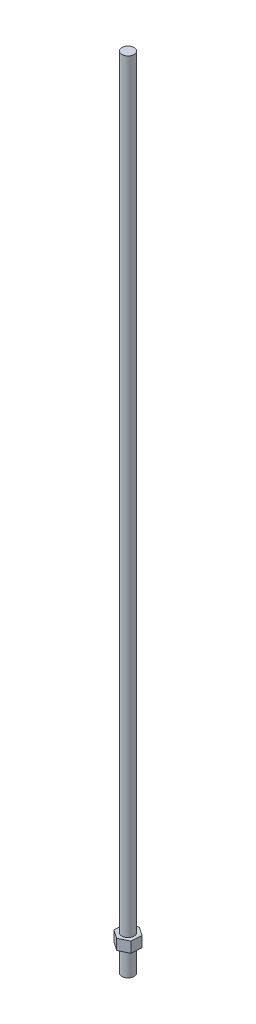
ISO-10303-21;
HEADER;
FILE_DESCRIPTION(('STEP AP214'),'2;1');
FILE_NAME('part.step','',(''),(''),'','','');
FILE_SCHEMA(('AUTOMOTIVE_DESIGN { 1 0 10303 214 1 1 1 1 }'));
ENDSEC;
DATA;
#1=APPLICATION_CONTEXT('core data for automotive mechanical design processes');
#2=APPLICATION_PROTOCOL_DEFINITION('international standard','automotive_design',2000,#1);
#3=PRODUCT_CONTEXT('',#1,'mechanical');
#4=PRODUCT('Part','Part','',(#3));
#5=PRODUCT_RELATED_PRODUCT_CATEGORY('part','',(#4));
#6=PRODUCT_DEFINITION_FORMATION('','',#4);
#7=PRODUCT_DEFINITION_CONTEXT('part definition',#1,'design');
#8=PRODUCT_DEFINITION('design','',#6,#7);
#9=PRODUCT_DEFINITION_SHAPE('','',#8);
#10=(LENGTH_UNIT() NAMED_UNIT(*) SI_UNIT(.MILLI.,.METRE.));
#11=(NAMED_UNIT(*) PLANE_ANGLE_UNIT() SI_UNIT($,.RADIAN.));
#12=(NAMED_UNIT(*) SI_UNIT($,.STERADIAN.) SOLID_ANGLE_UNIT());
#13=UNCERTAINTY_MEASURE_WITH_UNIT(LENGTH_MEASURE(1.E-05),#10,'distance_accuracy_value','');
#14=(GEOMETRIC_REPRESENTATION_CONTEXT(3) GLOBAL_UNCERTAINTY_ASSIGNED_CONTEXT((#13)) GLOBAL_UNIT_ASSIGNED_CONTEXT((#10,
#11,#12)) REPRESENTATION_CONTEXT('',''));
#15=CARTESIAN_POINT('',(0.,0.,0.));
#16=DIRECTION('',(0.,0.,1.));
#17=DIRECTION('',(1.,0.,0.));
#18=AXIS2_PLACEMENT_3D('',#15,#16,#17);
#19=CARTESIAN_POINT('',(0.,831.85,0.));
#20=DIRECTION('',(0.,-1.,0.));
#21=DIRECTION('',(0.,0.,-1.));
#22=AXIS2_PLACEMENT_3D('',#19,#20,#21);
#23=CYLINDRICAL_SURFACE('',#22,6.35);
#24=CARTESIAN_POINT('',(0.,36.449,0.));
#25=DIRECTION('',(0.,1.,0.));
#26=DIRECTION('',(0.,0.,1.));
#27=AXIS2_PLACEMENT_3D('',#24,#25,#26);
#28=CIRCLE('',#27,6.35);
#29=CARTESIAN_POINT('',(0.,36.449,6.35));
#30=VERTEX_POINT('',#29);
#31=EDGE_CURVE('E47',#30,#30,#28,.T.);
#32=ORIENTED_EDGE('',*,*,#31,.T.);
#33=EDGE_LOOP('',(#32));
#34=FACE_BOUND('',#33,.T.);
#35=CARTESIAN_POINT('',(0.,831.85,0.));
#36=DIRECTION('',(0.,1.,0.));
#37=DIRECTION('',(0.,0.,1.));
#38=AXIS2_PLACEMENT_3D('',#35,#36,#37);
#39=CIRCLE('',#38,6.35);
#40=CARTESIAN_POINT('',(0.,831.85,6.35));
#41=VERTEX_POINT('',#40);
#42=EDGE_CURVE('E53',#41,#41,#39,.T.);
#43=ORIENTED_EDGE('',*,*,#42,.F.);
#44=EDGE_LOOP('',(#43));
#45=FACE_BOUND('',#44,.T.);
#46=ADVANCED_FACE('F44',(#34,#45),#23,.T.);
#47=CARTESIAN_POINT('',(0.,831.85,0.));
#48=DIRECTION('',(0.,1.,0.));
#49=DIRECTION('',(0.,0.,1.));
#50=AXIS2_PLACEMENT_3D('',#47,#48,#49);
#51=PLANE('',#50);
#52=ORIENTED_EDGE('',*,*,#42,.T.);
#53=EDGE_LOOP('',(#52));
#54=FACE_BOUND('',#53,.T.);
#55=ADVANCED_FACE('F162',(#54),#51,.T.);
#56=CARTESIAN_POINT('',(0.,36.449,0.));
#57=DIRECTION('',(0.,1.,0.));
#58=DIRECTION('',(0.,0.,1.));
#59=AXIS2_PLACEMENT_3D('',#56,#57,#58);
#60=PLANE('',#59);
#61=DIRECTION('',(0.0679923661634542,0.,-0.99768584140675));
#62=VECTOR('',#61,1.);
#63=CARTESIAN_POINT('',(9.12904985050717,36.449,6.1341624389117));
#64=LINE('',#63,#62);
#65=CARTESIAN_POINT('',(9.12904985050717,36.449,6.1341624389117));
#66=VERTEX_POINT('',#65);
#67=CARTESIAN_POINT('',(9.87686542829142,36.449,-4.83890786349789));
#68=VERTEX_POINT('',#67);
#69=EDGE_CURVE('E141',#66,#68,#64,.T.);
#70=ORIENTED_EDGE('',*,*,#69,.T.);
#71=DIRECTION('',(-0.830025100572571,0.,-0.55772603706434));
#72=VECTOR('',#71,1.);
#73=CARTESIAN_POINT('',(9.87686542829142,36.449,-4.83890786349789));
#74=LINE('',#73,#72);
#75=CARTESIAN_POINT('',(0.747815577784257,36.449,-10.9730703024096));
#76=VERTEX_POINT('',#75);
#77=EDGE_CURVE('E99',#68,#76,#74,.T.);
#78=ORIENTED_EDGE('',*,*,#77,.T.);
#79=DIRECTION('',(-0.898017466736025,0.,0.43995980434241));
#80=VECTOR('',#79,1.);
#81=CARTESIAN_POINT('',(0.747815577784257,36.449,-10.9730703024096));
#82=LINE('',#81,#80);
#83=CARTESIAN_POINT('',(-9.12904985050717,36.449,-6.1341624389117));
#84=VERTEX_POINT('',#83);
#85=EDGE_CURVE('E113',#76,#84,#82,.T.);
#86=ORIENTED_EDGE('',*,*,#85,.T.);
#87=DIRECTION('',(-0.0679923661634545,0.,0.99768584140675));
#88=VECTOR('',#87,1.);
#89=CARTESIAN_POINT('',(-9.12904985050717,36.449,-6.1341624389117));
#90=LINE('',#89,#88);
#91=CARTESIAN_POINT('',(-9.87686542829143,36.449,4.83890786349789));
#92=VERTEX_POINT('',#91);
#93=EDGE_CURVE('E106',#84,#92,#90,.T.);
#94=ORIENTED_EDGE('',*,*,#93,.T.);
#95=DIRECTION('',(0.830025100572571,0.,0.55772603706434));
#96=VECTOR('',#95,1.);
#97=CARTESIAN_POINT('',(-9.87686542829143,36.449,4.83890786349789));
#98=LINE('',#97,#96);
#99=CARTESIAN_POINT('',(-0.747815577784261,36.449,10.9730703024096));
#100=VERTEX_POINT('',#99);
#101=EDGE_CURVE('E111',#92,#100,#98,.T.);
#102=ORIENTED_EDGE('',*,*,#101,.T.);
#103=DIRECTION('',(0.898017466736025,0.,-0.43995980434241));
#104=VECTOR('',#103,1.);
#105=CARTESIAN_POINT('',(-0.747815577784261,36.449,10.9730703024096));
#106=LINE('',#105,#104);
#107=EDGE_CURVE('E61',#100,#66,#106,.T.);
#108=ORIENTED_EDGE('',*,*,#107,.T.);
#109=EDGE_LOOP('',(#70,#78,#86,#94,#102,#108));
#110=FACE_BOUND('',#109,.T.);
#111=ORIENTED_EDGE('',*,*,#31,.F.);
#112=EDGE_LOOP('',(#111));
#113=FACE_BOUND('',#112,.T.);
#114=ADVANCED_FACE('F108',(#110,#113),#60,.T.);
#115=CARTESIAN_POINT('',(0.,25.4,0.));
#116=DIRECTION('',(0.,1.,0.));
#117=DIRECTION('',(0.,0.,1.));
#118=AXIS2_PLACEMENT_3D('',#115,#116,#117);
#119=PLANE('',#118);
#120=DIRECTION('',(0.0679923661634542,0.,-0.99768584140675));
#121=VECTOR('',#120,1.);
#122=CARTESIAN_POINT('',(9.12904985050717,25.4,6.1341624389117));
#123=LINE('',#122,#121);
#124=CARTESIAN_POINT('',(9.12904985050717,25.4,6.1341624389117));
#125=VERTEX_POINT('',#124);
#126=CARTESIAN_POINT('',(9.87686542829142,25.4,-4.83890786349789));
#127=VERTEX_POINT('',#126);
#128=EDGE_CURVE('E131',#125,#127,#123,.T.);
#129=ORIENTED_EDGE('',*,*,#128,.F.);
#130=DIRECTION('',(0.898017466736025,0.,-0.43995980434241));
#131=VECTOR('',#130,1.);
#132=CARTESIAN_POINT('',(-0.747815577784261,25.4,10.9730703024096));
#133=LINE('',#132,#131);
#134=CARTESIAN_POINT('',(-0.747815577784261,25.4,10.9730703024096));
#135=VERTEX_POINT('',#134);
#136=EDGE_CURVE('E90',#135,#125,#133,.T.);
#137=ORIENTED_EDGE('',*,*,#136,.F.);
#138=DIRECTION('',(0.830025100572571,0.,0.55772603706434));
#139=VECTOR('',#138,1.);
#140=CARTESIAN_POINT('',(-9.87686542829143,25.4,4.83890786349789));
#141=LINE('',#140,#139);
#142=CARTESIAN_POINT('',(-9.87686542829143,25.4,4.83890786349789));
#143=VERTEX_POINT('',#142);
#144=EDGE_CURVE('E84',#143,#135,#141,.T.);
#145=ORIENTED_EDGE('',*,*,#144,.F.);
#146=DIRECTION('',(-0.0679923661634545,0.,0.99768584140675));
#147=VECTOR('',#146,1.);
#148=CARTESIAN_POINT('',(-9.12904985050717,25.4,-6.1341624389117));
#149=LINE('',#148,#147);
#150=CARTESIAN_POINT('',(-9.12904985050717,25.4,-6.1341624389117));
#151=VERTEX_POINT('',#150);
#152=EDGE_CURVE('E121',#151,#143,#149,.T.);
#153=ORIENTED_EDGE('',*,*,#152,.F.);
#154=DIRECTION('',(-0.898017466736025,0.,0.43995980434241));
#155=VECTOR('',#154,1.);
#156=CARTESIAN_POINT('',(0.747815577784257,25.4,-10.9730703024096));
#157=LINE('',#156,#155);
#158=CARTESIAN_POINT('',(0.747815577784257,25.4,-10.9730703024096));
#159=VERTEX_POINT('',#158);
#160=EDGE_CURVE('E136',#159,#151,#157,.T.);
#161=ORIENTED_EDGE('',*,*,#160,.F.);
#162=DIRECTION('',(-0.830025100572571,0.,-0.55772603706434));
#163=VECTOR('',#162,1.);
#164=CARTESIAN_POINT('',(9.87686542829142,25.4,-4.83890786349789));
#165=LINE('',#164,#163);
#166=EDGE_CURVE('E134',#127,#159,#165,.T.);
#167=ORIENTED_EDGE('',*,*,#166,.F.);
#168=EDGE_LOOP('',(#129,#137,#145,#153,#161,#167));
#169=FACE_BOUND('',#168,.T.);
#170=CARTESIAN_POINT('',(0.,25.4,0.));
#171=DIRECTION('',(0.,1.,0.));
#172=DIRECTION('',(0.,0.,1.));
#173=AXIS2_PLACEMENT_3D('',#170,#171,#172);
#174=CIRCLE('',#173,6.35);
#175=CARTESIAN_POINT('',(0.,25.4,6.35));
#176=VERTEX_POINT('',#175);
#177=EDGE_CURVE('E13',#176,#176,#174,.T.);
#178=ORIENTED_EDGE('',*,*,#177,.T.);
#179=EDGE_LOOP('',(#178));
#180=FACE_BOUND('',#179,.T.);
#181=ADVANCED_FACE('F161',(#169,#180),#119,.F.);
#182=CARTESIAN_POINT('',(9.12904985050717,36.449,6.1341624389117));
#183=DIRECTION('',(-0.99768584140675,0.,-0.0679923661634542));
#184=DIRECTION('',(-0.0679923661634542,0.,0.99768584140675));
#185=AXIS2_PLACEMENT_3D('',#182,#183,#184);
#186=PLANE('',#185);
#187=ORIENTED_EDGE('',*,*,#128,.T.);
#188=DIRECTION('',(0.,-1.,0.));
#189=VECTOR('',#188,1.);
#190=CARTESIAN_POINT('',(9.87686542829142,36.449,-4.83890786349789));
#191=LINE('',#190,#189);
#192=EDGE_CURVE('E148',#68,#127,#191,.T.);
#193=ORIENTED_EDGE('',*,*,#192,.F.);
#194=ORIENTED_EDGE('',*,*,#69,.F.);
#195=DIRECTION('',(0.,-1.,0.));
#196=VECTOR('',#195,1.);
#197=CARTESIAN_POINT('',(9.12904985050717,36.449,6.1341624389117));
#198=LINE('',#197,#196);
#199=EDGE_CURVE('E127',#66,#125,#198,.T.);
#200=ORIENTED_EDGE('',*,*,#199,.T.);
#201=EDGE_LOOP('',(#187,#193,#194,#200));
#202=FACE_BOUND('',#201,.T.);
#203=ADVANCED_FACE('F168',(#202),#186,.F.);
#204=CARTESIAN_POINT('',(9.87686542829142,36.449,-4.83890786349789));
#205=DIRECTION('',(-0.55772603706434,0.,0.830025100572571));
#206=DIRECTION('',(0.830025100572571,0.,0.55772603706434));
#207=AXIS2_PLACEMENT_3D('',#204,#205,#206);
#208=PLANE('',#207);
#209=ORIENTED_EDGE('',*,*,#166,.T.);
#210=DIRECTION('',(0.,-1.,0.));
#211=VECTOR('',#210,1.);
#212=CARTESIAN_POINT('',(0.747815577784257,36.449,-10.9730703024096));
#213=LINE('',#212,#211);
#214=EDGE_CURVE('E145',#76,#159,#213,.T.);
#215=ORIENTED_EDGE('',*,*,#214,.F.);
#216=ORIENTED_EDGE('',*,*,#77,.F.);
#217=ORIENTED_EDGE('',*,*,#192,.T.);
#218=EDGE_LOOP('',(#209,#215,#216,#217));
#219=FACE_BOUND('',#218,.T.);
#220=ADVANCED_FACE('F194',(#219),#208,.F.);
#221=CARTESIAN_POINT('',(0.747815577784257,36.449,-10.9730703024096));
#222=DIRECTION('',(0.43995980434241,0.,0.898017466736025));
#223=DIRECTION('',(0.898017466736025,0.,-0.43995980434241));
#224=AXIS2_PLACEMENT_3D('',#221,#222,#223);
#225=PLANE('',#224);
#226=ORIENTED_EDGE('',*,*,#160,.T.);
#227=DIRECTION('',(0.,-1.,0.));
#228=VECTOR('',#227,1.);
#229=CARTESIAN_POINT('',(-9.12904985050717,36.449,-6.1341624389117));
#230=LINE('',#229,#228);
#231=EDGE_CURVE('E122',#84,#151,#230,.T.);
#232=ORIENTED_EDGE('',*,*,#231,.F.);
#233=ORIENTED_EDGE('',*,*,#85,.F.);
#234=ORIENTED_EDGE('',*,*,#214,.T.);
#235=EDGE_LOOP('',(#226,#232,#233,#234));
#236=FACE_BOUND('',#235,.T.);
#237=ADVANCED_FACE('F198',(#236),#225,.F.);
#238=CARTESIAN_POINT('',(-9.12904985050717,36.449,-6.1341624389117));
#239=DIRECTION('',(0.99768584140675,0.,0.0679923661634545));
#240=DIRECTION('',(0.0679923661634545,0.,-0.99768584140675));
#241=AXIS2_PLACEMENT_3D('',#238,#239,#240);
#242=PLANE('',#241);
#243=ORIENTED_EDGE('',*,*,#152,.T.);
#244=DIRECTION('',(0.,-1.,0.));
#245=VECTOR('',#244,1.);
#246=CARTESIAN_POINT('',(-9.87686542829143,36.449,4.83890786349789));
#247=LINE('',#246,#245);
#248=EDGE_CURVE('E118',#92,#143,#247,.T.);
#249=ORIENTED_EDGE('',*,*,#248,.F.);
#250=ORIENTED_EDGE('',*,*,#93,.F.);
#251=ORIENTED_EDGE('',*,*,#231,.T.);
#252=EDGE_LOOP('',(#243,#249,#250,#251));
#253=FACE_BOUND('',#252,.T.);
#254=ADVANCED_FACE('F119',(#253),#242,.F.);
#255=CARTESIAN_POINT('',(-9.87686542829143,36.449,4.83890786349789));
#256=DIRECTION('',(0.55772603706434,0.,-0.830025100572571));
#257=DIRECTION('',(-0.830025100572571,0.,-0.55772603706434));
#258=AXIS2_PLACEMENT_3D('',#255,#256,#257);
#259=PLANE('',#258);
#260=ORIENTED_EDGE('',*,*,#144,.T.);
#261=DIRECTION('',(0.,-1.,0.));
#262=VECTOR('',#261,1.);
#263=CARTESIAN_POINT('',(-0.747815577784261,36.449,10.9730703024096));
#264=LINE('',#263,#262);
#265=EDGE_CURVE('E123',#100,#135,#264,.T.);
#266=ORIENTED_EDGE('',*,*,#265,.F.);
#267=ORIENTED_EDGE('',*,*,#101,.F.);
#268=ORIENTED_EDGE('',*,*,#248,.T.);
#269=EDGE_LOOP('',(#260,#266,#267,#268));
#270=FACE_BOUND('',#269,.T.);
#271=ADVANCED_FACE('F125',(#270),#259,.F.);
#272=CARTESIAN_POINT('',(-0.747815577784261,36.449,10.9730703024096));
#273=DIRECTION('',(-0.43995980434241,0.,-0.898017466736025));
#274=DIRECTION('',(-0.898017466736026,0.,0.43995980434241));
#275=AXIS2_PLACEMENT_3D('',#272,#273,#274);
#276=PLANE('',#275);
#277=ORIENTED_EDGE('',*,*,#136,.T.);
#278=ORIENTED_EDGE('',*,*,#199,.F.);
#279=ORIENTED_EDGE('',*,*,#107,.F.);
#280=ORIENTED_EDGE('',*,*,#265,.T.);
#281=EDGE_LOOP('',(#277,#278,#279,#280));
#282=FACE_BOUND('',#281,.T.);
#283=ADVANCED_FACE('F182',(#282),#276,.F.);
#284=CARTESIAN_POINT('',(0.,0.,0.));
#285=DIRECTION('',(0.,1.,0.));
#286=DIRECTION('',(0.,0.,1.));
#287=AXIS2_PLACEMENT_3D('',#284,#285,#286);
#288=PLANE('',#287);
#289=CARTESIAN_POINT('',(0.,0.,0.));
#290=DIRECTION('',(0.,1.,0.));
#291=DIRECTION('',(0.,0.,1.));
#292=AXIS2_PLACEMENT_3D('',#289,#290,#291);
#293=CIRCLE('',#292,6.35);
#294=CARTESIAN_POINT('',(0.,0.,6.35));
#295=VERTEX_POINT('',#294);
#296=EDGE_CURVE('E152',#295,#295,#293,.T.);
#297=ORIENTED_EDGE('',*,*,#296,.F.);
#298=EDGE_LOOP('',(#297));
#299=FACE_BOUND('',#298,.T.);
#300=ADVANCED_FACE('F178',(#299),#288,.F.);
#301=ORIENTED_EDGE('',*,*,#296,.T.);
#302=EDGE_LOOP('',(#301));
#303=FACE_BOUND('',#302,.T.);
#304=ORIENTED_EDGE('',*,*,#177,.F.);
#305=EDGE_LOOP('',(#304));
#306=FACE_BOUND('',#305,.T.);
#307=ADVANCED_FACE('F174',(#303,#306),#23,.T.);
#308=CLOSED_SHELL('',(#46,#55,#114,#181,#203,#220,#237,#254,#271,#283,#300,#307));
#309=MANIFOLD_SOLID_BREP('B2',#308);
#310=ADVANCED_BREP_SHAPE_REPRESENTATION('',(#18,#309),#14);
#311=SHAPE_DEFINITION_REPRESENTATION(#9,#310);
ENDSEC;
END-ISO-10303-21;
